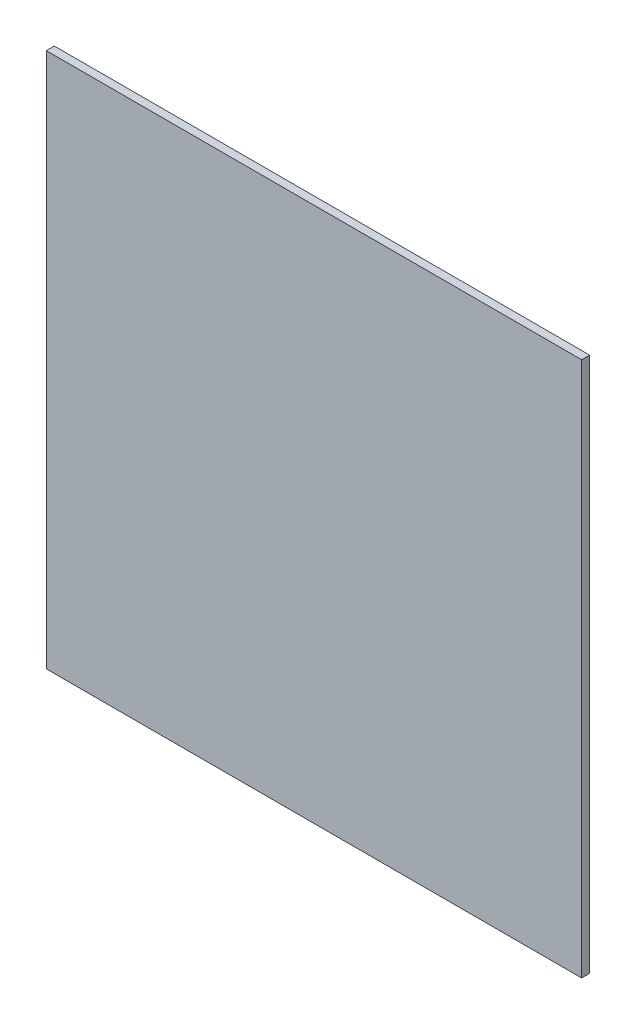
ISO-10303-21;
HEADER;
FILE_DESCRIPTION(('STEP AP214'),'2;1');
FILE_NAME('part.step','',(''),(''),'','','');
FILE_SCHEMA(('AUTOMOTIVE_DESIGN { 1 0 10303 214 1 1 1 1 }'));
ENDSEC;
DATA;
#1=APPLICATION_CONTEXT('core data for automotive mechanical design processes');
#2=APPLICATION_PROTOCOL_DEFINITION('international standard','automotive_design',2000,#1);
#3=PRODUCT_CONTEXT('',#1,'mechanical');
#4=PRODUCT('Part','Part','',(#3));
#5=PRODUCT_RELATED_PRODUCT_CATEGORY('part','',(#4));
#6=PRODUCT_DEFINITION_FORMATION('','',#4);
#7=PRODUCT_DEFINITION_CONTEXT('part definition',#1,'design');
#8=PRODUCT_DEFINITION('design','',#6,#7);
#9=PRODUCT_DEFINITION_SHAPE('','',#8);
#10=(LENGTH_UNIT() NAMED_UNIT(*) SI_UNIT(.MILLI.,.METRE.));
#11=(NAMED_UNIT(*) PLANE_ANGLE_UNIT() SI_UNIT($,.RADIAN.));
#12=(NAMED_UNIT(*) SI_UNIT($,.STERADIAN.) SOLID_ANGLE_UNIT());
#13=UNCERTAINTY_MEASURE_WITH_UNIT(LENGTH_MEASURE(1.E-05),#10,'distance_accuracy_value','');
#14=(GEOMETRIC_REPRESENTATION_CONTEXT(3) GLOBAL_UNCERTAINTY_ASSIGNED_CONTEXT((#13)) GLOBAL_UNIT_ASSIGNED_CONTEXT((#10,
#11,#12)) REPRESENTATION_CONTEXT('',''));
#15=CARTESIAN_POINT('',(0.,0.,0.));
#16=DIRECTION('',(0.,0.,1.));
#17=DIRECTION('',(1.,0.,0.));
#18=AXIS2_PLACEMENT_3D('',#15,#16,#17);
#19=CARTESIAN_POINT('',(-106.98684676364,-295.605276029018,3.));
#20=DIRECTION('',(1.,0.,0.));
#21=DIRECTION('',(0.,0.,-1.));
#22=AXIS2_PLACEMENT_3D('',#19,#20,#21);
#23=PLANE('',#22);
#24=DIRECTION('',(0.,-1.,0.));
#25=VECTOR('',#24,1.);
#26=CARTESIAN_POINT('',(-106.98684676364,-295.605276029018,0.));
#27=LINE('',#26,#25);
#28=CARTESIAN_POINT('',(-106.98684676364,-295.605276029018,0.));
#29=VERTEX_POINT('',#28);
#30=CARTESIAN_POINT('',(-106.98684676364,-495.605276029018,0.));
#31=VERTEX_POINT('',#30);
#32=EDGE_CURVE('E98',#29,#31,#27,.T.);
#33=ORIENTED_EDGE('',*,*,#32,.T.);
#34=DIRECTION('',(0.,0.,-1.));
#35=VECTOR('',#34,1.);
#36=CARTESIAN_POINT('',(-106.98684676364,-495.605276029018,3.));
#37=LINE('',#36,#35);
#38=CARTESIAN_POINT('',(-106.98684676364,-495.605276029018,3.));
#39=VERTEX_POINT('',#38);
#40=EDGE_CURVE('E11',#39,#31,#37,.T.);
#41=ORIENTED_EDGE('',*,*,#40,.F.);
#42=DIRECTION('',(0.,-1.,0.));
#43=VECTOR('',#42,1.);
#44=CARTESIAN_POINT('',(-106.98684676364,-295.605276029018,3.));
#45=LINE('',#44,#43);
#46=CARTESIAN_POINT('',(-106.98684676364,-295.605276029018,3.));
#47=VERTEX_POINT('',#46);
#48=EDGE_CURVE('E86',#47,#39,#45,.T.);
#49=ORIENTED_EDGE('',*,*,#48,.F.);
#50=DIRECTION('',(0.,0.,-1.));
#51=VECTOR('',#50,1.);
#52=CARTESIAN_POINT('',(-106.98684676364,-295.605276029018,3.));
#53=LINE('',#52,#51);
#54=EDGE_CURVE('E94',#47,#29,#53,.T.);
#55=ORIENTED_EDGE('',*,*,#54,.T.);
#56=EDGE_LOOP('',(#33,#41,#49,#55));
#57=FACE_BOUND('',#56,.T.);
#58=ADVANCED_FACE('F35',(#57),#23,.F.);
#59=CARTESIAN_POINT('',(-106.98684676364,-495.605276029018,3.));
#60=DIRECTION('',(0.,1.,0.));
#61=DIRECTION('',(0.,0.,1.));
#62=AXIS2_PLACEMENT_3D('',#59,#60,#61);
#63=PLANE('',#62);
#64=DIRECTION('',(1.,0.,0.));
#65=VECTOR('',#64,1.);
#66=CARTESIAN_POINT('',(-106.98684676364,-495.605276029018,0.));
#67=LINE('',#66,#65);
#68=CARTESIAN_POINT('',(93.0131532363603,-495.605276029018,0.));
#69=VERTEX_POINT('',#68);
#70=EDGE_CURVE('E90',#31,#69,#67,.T.);
#71=ORIENTED_EDGE('',*,*,#70,.T.);
#72=DIRECTION('',(0.,0.,-1.));
#73=VECTOR('',#72,1.);
#74=CARTESIAN_POINT('',(93.0131532363603,-495.605276029018,3.));
#75=LINE('',#74,#73);
#76=CARTESIAN_POINT('',(93.0131532363603,-495.605276029018,3.));
#77=VERTEX_POINT('',#76);
#78=EDGE_CURVE('E43',#77,#69,#75,.T.);
#79=ORIENTED_EDGE('',*,*,#78,.F.);
#80=DIRECTION('',(1.,0.,0.));
#81=VECTOR('',#80,1.);
#82=CARTESIAN_POINT('',(-106.98684676364,-495.605276029018,3.));
#83=LINE('',#82,#81);
#84=EDGE_CURVE('E81',#39,#77,#83,.T.);
#85=ORIENTED_EDGE('',*,*,#84,.F.);
#86=ORIENTED_EDGE('',*,*,#40,.T.);
#87=EDGE_LOOP('',(#71,#79,#85,#86));
#88=FACE_BOUND('',#87,.T.);
#89=ADVANCED_FACE('F89',(#88),#63,.F.);
#90=CARTESIAN_POINT('',(93.0131532363603,-295.605276029018,3.));
#91=DIRECTION('',(-1.,0.,0.));
#92=DIRECTION('',(0.,0.,1.));
#93=AXIS2_PLACEMENT_3D('',#90,#91,#92);
#94=PLANE('',#93);
#95=DIRECTION('',(0.,1.,0.));
#96=VECTOR('',#95,1.);
#97=CARTESIAN_POINT('',(93.0131532363603,-295.605276029018,0.));
#98=LINE('',#97,#96);
#99=CARTESIAN_POINT('',(93.0131532363603,-295.605276029018,0.));
#100=VERTEX_POINT('',#99);
#101=EDGE_CURVE('E68',#69,#100,#98,.T.);
#102=ORIENTED_EDGE('',*,*,#101,.T.);
#103=DIRECTION('',(0.,0.,-1.));
#104=VECTOR('',#103,1.);
#105=CARTESIAN_POINT('',(93.0131532363603,-295.605276029018,3.));
#106=LINE('',#105,#104);
#107=CARTESIAN_POINT('',(93.0131532363603,-295.605276029018,3.));
#108=VERTEX_POINT('',#107);
#109=EDGE_CURVE('E91',#108,#100,#106,.T.);
#110=ORIENTED_EDGE('',*,*,#109,.F.);
#111=DIRECTION('',(0.,1.,0.));
#112=VECTOR('',#111,1.);
#113=CARTESIAN_POINT('',(93.0131532363603,-295.605276029018,3.));
#114=LINE('',#113,#112);
#115=EDGE_CURVE('E84',#77,#108,#114,.T.);
#116=ORIENTED_EDGE('',*,*,#115,.F.);
#117=ORIENTED_EDGE('',*,*,#78,.T.);
#118=EDGE_LOOP('',(#102,#110,#116,#117));
#119=FACE_BOUND('',#118,.T.);
#120=ADVANCED_FACE('F92',(#119),#94,.F.);
#121=CARTESIAN_POINT('',(-106.98684676364,-295.605276029018,3.));
#122=DIRECTION('',(0.,-1.,0.));
#123=DIRECTION('',(0.,0.,-1.));
#124=AXIS2_PLACEMENT_3D('',#121,#122,#123);
#125=PLANE('',#124);
#126=DIRECTION('',(-1.,0.,0.));
#127=VECTOR('',#126,1.);
#128=CARTESIAN_POINT('',(-106.98684676364,-295.605276029018,0.));
#129=LINE('',#128,#127);
#130=EDGE_CURVE('E74',#100,#29,#129,.T.);
#131=ORIENTED_EDGE('',*,*,#130,.T.);
#132=ORIENTED_EDGE('',*,*,#54,.F.);
#133=DIRECTION('',(-1.,0.,0.));
#134=VECTOR('',#133,1.);
#135=CARTESIAN_POINT('',(-106.98684676364,-295.605276029018,3.));
#136=LINE('',#135,#134);
#137=EDGE_CURVE('E51',#108,#47,#136,.T.);
#138=ORIENTED_EDGE('',*,*,#137,.F.);
#139=ORIENTED_EDGE('',*,*,#109,.T.);
#140=EDGE_LOOP('',(#131,#132,#138,#139));
#141=FACE_BOUND('',#140,.T.);
#142=ADVANCED_FACE('F105',(#141),#125,.F.);
#143=CARTESIAN_POINT('',(0.,0.,3.));
#144=DIRECTION('',(0.,0.,1.));
#145=DIRECTION('',(1.,0.,0.));
#146=AXIS2_PLACEMENT_3D('',#143,#144,#145);
#147=PLANE('',#146);
#148=ORIENTED_EDGE('',*,*,#48,.T.);
#149=ORIENTED_EDGE('',*,*,#84,.T.);
#150=ORIENTED_EDGE('',*,*,#115,.T.);
#151=ORIENTED_EDGE('',*,*,#137,.T.);
#152=EDGE_LOOP('',(#148,#149,#150,#151));
#153=FACE_BOUND('',#152,.T.);
#154=ADVANCED_FACE('F82',(#153),#147,.T.);
#155=CARTESIAN_POINT('',(0.,0.,0.));
#156=DIRECTION('',(0.,0.,1.));
#157=DIRECTION('',(1.,0.,0.));
#158=AXIS2_PLACEMENT_3D('',#155,#156,#157);
#159=PLANE('',#158);
#160=ORIENTED_EDGE('',*,*,#32,.F.);
#161=ORIENTED_EDGE('',*,*,#130,.F.);
#162=ORIENTED_EDGE('',*,*,#101,.F.);
#163=ORIENTED_EDGE('',*,*,#70,.F.);
#164=EDGE_LOOP('',(#160,#161,#162,#163));
#165=FACE_BOUND('',#164,.T.);
#166=ADVANCED_FACE('F108',(#165),#159,.F.);
#167=CLOSED_SHELL('',(#58,#89,#120,#142,#154,#166));
#168=MANIFOLD_SOLID_BREP('B2',#167);
#169=ADVANCED_BREP_SHAPE_REPRESENTATION('',(#18,#168),#14);
#170=SHAPE_DEFINITION_REPRESENTATION(#9,#169);
ENDSEC;
END-ISO-10303-21;
